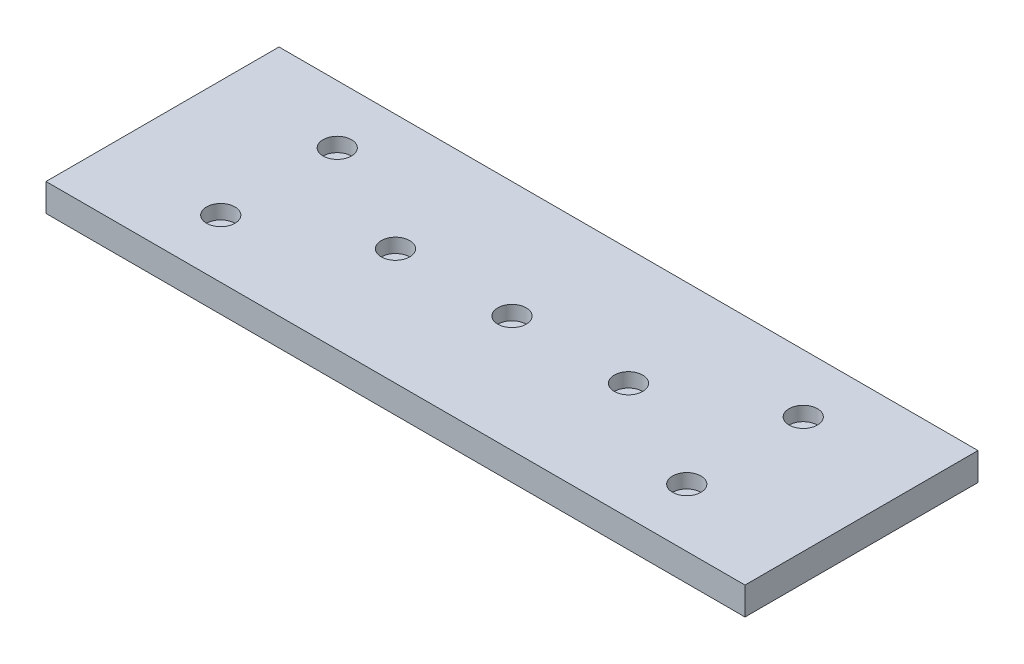
ISO-10303-21;
HEADER;
FILE_DESCRIPTION(('STEP AP214'),'2;1');
FILE_NAME('part.step','',(''),(''),'','','');
FILE_SCHEMA(('AUTOMOTIVE_DESIGN { 1 0 10303 214 1 1 1 1 }'));
ENDSEC;
DATA;
#1=APPLICATION_CONTEXT('core data for automotive mechanical design processes');
#2=APPLICATION_PROTOCOL_DEFINITION('international standard','automotive_design',2000,#1);
#3=PRODUCT_CONTEXT('',#1,'mechanical');
#4=PRODUCT('Part','Part','',(#3));
#5=PRODUCT_RELATED_PRODUCT_CATEGORY('part','',(#4));
#6=PRODUCT_DEFINITION_FORMATION('','',#4);
#7=PRODUCT_DEFINITION_CONTEXT('part definition',#1,'design');
#8=PRODUCT_DEFINITION('design','',#6,#7);
#9=PRODUCT_DEFINITION_SHAPE('','',#8);
#10=(LENGTH_UNIT() NAMED_UNIT(*) SI_UNIT(.MILLI.,.METRE.));
#11=(NAMED_UNIT(*) PLANE_ANGLE_UNIT() SI_UNIT($,.RADIAN.));
#12=(NAMED_UNIT(*) SI_UNIT($,.STERADIAN.) SOLID_ANGLE_UNIT());
#13=UNCERTAINTY_MEASURE_WITH_UNIT(LENGTH_MEASURE(1.E-05),#10,'distance_accuracy_value','');
#14=(GEOMETRIC_REPRESENTATION_CONTEXT(3) GLOBAL_UNCERTAINTY_ASSIGNED_CONTEXT((#13)) GLOBAL_UNIT_ASSIGNED_CONTEXT((#10,
#11,#12)) REPRESENTATION_CONTEXT('',''));
#15=CARTESIAN_POINT('',(0.,0.,0.));
#16=DIRECTION('',(0.,0.,1.));
#17=DIRECTION('',(1.,0.,0.));
#18=AXIS2_PLACEMENT_3D('',#15,#16,#17);
#19=CARTESIAN_POINT('',(0.,5.95,0.));
#20=DIRECTION('',(0.,1.,0.));
#21=DIRECTION('',(0.,0.,1.));
#22=AXIS2_PLACEMENT_3D('',#19,#20,#21);
#23=PLANE('',#22);
#24=CARTESIAN_POINT('',(-125.,5.95,-12.5));
#25=DIRECTION('',(0.,-1.,0.));
#26=DIRECTION('',(0.,0.,-1.));
#27=AXIS2_PLACEMENT_3D('',#24,#25,#26);
#28=CIRCLE('',#27,3.05000000000002);
#29=CARTESIAN_POINT('',(-125.,5.95,-15.55));
#30=VERTEX_POINT('',#29);
#31=EDGE_CURVE('E173',#30,#30,#28,.T.);
#32=ORIENTED_EDGE('',*,*,#31,.T.);
#33=EDGE_LOOP('',(#32));
#34=FACE_BOUND('',#33,.T.);
#35=CARTESIAN_POINT('',(-100.,5.95,-25.));
#36=DIRECTION('',(0.,-1.,0.));
#37=DIRECTION('',(0.,0.,-1.));
#38=AXIS2_PLACEMENT_3D('',#35,#36,#37);
#39=CIRCLE('',#38,3.04999999999999);
#40=CARTESIAN_POINT('',(-100.,5.95,-28.05));
#41=VERTEX_POINT('',#40);
#42=EDGE_CURVE('E133',#41,#41,#39,.T.);
#43=ORIENTED_EDGE('',*,*,#42,.T.);
#44=EDGE_LOOP('',(#43));
#45=FACE_BOUND('',#44,.T.);
#46=CARTESIAN_POINT('',(-125.,5.95,-37.5));
#47=DIRECTION('',(0.,-1.,0.));
#48=DIRECTION('',(0.,0.,-1.));
#49=AXIS2_PLACEMENT_3D('',#46,#47,#48);
#50=CIRCLE('',#49,3.05000000000002);
#51=CARTESIAN_POINT('',(-125.,5.95,-40.55));
#52=VERTEX_POINT('',#51);
#53=EDGE_CURVE('E129',#52,#52,#50,.T.);
#54=ORIENTED_EDGE('',*,*,#53,.T.);
#55=EDGE_LOOP('',(#54));
#56=FACE_BOUND('',#55,.T.);
#57=DIRECTION('',(0.,0.,-1.));
#58=VECTOR('',#57,1.);
#59=CARTESIAN_POINT('',(0.,5.95,0.));
#60=LINE('',#59,#58);
#61=CARTESIAN_POINT('',(0.,5.95,0.));
#62=VERTEX_POINT('',#61);
#63=CARTESIAN_POINT('',(0.,5.95,-50.));
#64=VERTEX_POINT('',#63);
#65=EDGE_CURVE('E92',#62,#64,#60,.T.);
#66=ORIENTED_EDGE('',*,*,#65,.T.);
#67=DIRECTION('',(-1.,0.,0.));
#68=VECTOR('',#67,1.);
#69=CARTESIAN_POINT('',(0.,5.95,-50.));
#70=LINE('',#69,#68);
#71=CARTESIAN_POINT('',(-150.,5.95,-50.));
#72=VERTEX_POINT('',#71);
#73=EDGE_CURVE('E87',#64,#72,#70,.T.);
#74=ORIENTED_EDGE('',*,*,#73,.T.);
#75=DIRECTION('',(0.,0.,1.));
#76=VECTOR('',#75,1.);
#77=CARTESIAN_POINT('',(-150.,5.95,0.));
#78=LINE('',#77,#76);
#79=CARTESIAN_POINT('',(-150.,5.95,0.));
#80=VERTEX_POINT('',#79);
#81=EDGE_CURVE('E90',#72,#80,#78,.T.);
#82=ORIENTED_EDGE('',*,*,#81,.T.);
#83=DIRECTION('',(1.,0.,0.));
#84=VECTOR('',#83,1.);
#85=CARTESIAN_POINT('',(0.,5.95,0.));
#86=LINE('',#85,#84);
#87=EDGE_CURVE('E57',#80,#62,#86,.T.);
#88=ORIENTED_EDGE('',*,*,#87,.T.);
#89=EDGE_LOOP('',(#66,#74,#82,#88));
#90=FACE_BOUND('',#89,.T.);
#91=CARTESIAN_POINT('',(-75.,5.95,-25.));
#92=DIRECTION('',(0.,1.,0.));
#93=DIRECTION('',(0.,0.,1.));
#94=AXIS2_PLACEMENT_3D('',#91,#92,#93);
#95=CIRCLE('',#94,3.04999999999999);
#96=CARTESIAN_POINT('',(-75.,5.95,-21.95));
#97=VERTEX_POINT('',#96);
#98=EDGE_CURVE('E165',#97,#97,#95,.T.);
#99=ORIENTED_EDGE('',*,*,#98,.F.);
#100=EDGE_LOOP('',(#99));
#101=FACE_BOUND('',#100,.T.);
#102=CARTESIAN_POINT('',(-50.,5.95,-25.));
#103=DIRECTION('',(0.,1.,0.));
#104=DIRECTION('',(0.,0.,1.));
#105=AXIS2_PLACEMENT_3D('',#102,#103,#104);
#106=CIRCLE('',#105,3.05);
#107=CARTESIAN_POINT('',(-50.,5.95,-21.95));
#108=VERTEX_POINT('',#107);
#109=EDGE_CURVE('E157',#108,#108,#106,.T.);
#110=ORIENTED_EDGE('',*,*,#109,.F.);
#111=EDGE_LOOP('',(#110));
#112=FACE_BOUND('',#111,.T.);
#113=CARTESIAN_POINT('',(-25.,5.95,-12.5));
#114=DIRECTION('',(0.,1.,0.));
#115=DIRECTION('',(0.,0.,1.));
#116=AXIS2_PLACEMENT_3D('',#113,#114,#115);
#117=CIRCLE('',#116,3.05);
#118=CARTESIAN_POINT('',(-25.,5.95,-9.45));
#119=VERTEX_POINT('',#118);
#120=EDGE_CURVE('E149',#119,#119,#117,.T.);
#121=ORIENTED_EDGE('',*,*,#120,.F.);
#122=EDGE_LOOP('',(#121));
#123=FACE_BOUND('',#122,.T.);
#124=CARTESIAN_POINT('',(-25.,5.95,-37.5));
#125=DIRECTION('',(0.,1.,0.));
#126=DIRECTION('',(0.,0.,1.));
#127=AXIS2_PLACEMENT_3D('',#124,#125,#126);
#128=CIRCLE('',#127,3.05);
#129=CARTESIAN_POINT('',(-25.,5.95,-34.45));
#130=VERTEX_POINT('',#129);
#131=EDGE_CURVE('E141',#130,#130,#128,.T.);
#132=ORIENTED_EDGE('',*,*,#131,.F.);
#133=EDGE_LOOP('',(#132));
#134=FACE_BOUND('',#133,.T.);
#135=ADVANCED_FACE('F39',(#34,#45,#56,#90,#101,#112,#123,#134),#23,.T.);
#136=CARTESIAN_POINT('',(0.,5.95,0.));
#137=DIRECTION('',(-1.,0.,0.));
#138=DIRECTION('',(0.,0.,1.));
#139=AXIS2_PLACEMENT_3D('',#136,#137,#138);
#140=PLANE('',#139);
#141=DIRECTION('',(0.,0.,-1.));
#142=VECTOR('',#141,1.);
#143=CARTESIAN_POINT('',(0.,0.,0.));
#144=LINE('',#143,#142);
#145=CARTESIAN_POINT('',(0.,0.,0.));
#146=VERTEX_POINT('',#145);
#147=CARTESIAN_POINT('',(0.,0.,-50.));
#148=VERTEX_POINT('',#147);
#149=EDGE_CURVE('E108',#146,#148,#144,.T.);
#150=ORIENTED_EDGE('',*,*,#149,.T.);
#151=DIRECTION('',(0.,-1.,0.));
#152=VECTOR('',#151,1.);
#153=CARTESIAN_POINT('',(0.,5.95,-50.));
#154=LINE('',#153,#152);
#155=EDGE_CURVE('E11',#64,#148,#154,.T.);
#156=ORIENTED_EDGE('',*,*,#155,.F.);
#157=ORIENTED_EDGE('',*,*,#65,.F.);
#158=DIRECTION('',(0.,-1.,0.));
#159=VECTOR('',#158,1.);
#160=CARTESIAN_POINT('',(0.,5.95,0.));
#161=LINE('',#160,#159);
#162=EDGE_CURVE('E104',#62,#146,#161,.T.);
#163=ORIENTED_EDGE('',*,*,#162,.T.);
#164=EDGE_LOOP('',(#150,#156,#157,#163));
#165=FACE_BOUND('',#164,.T.);
#166=ADVANCED_FACE('F41',(#165),#140,.F.);
#167=CARTESIAN_POINT('',(0.,5.95,-50.));
#168=DIRECTION('',(0.,0.,1.));
#169=DIRECTION('',(1.,0.,0.));
#170=AXIS2_PLACEMENT_3D('',#167,#168,#169);
#171=PLANE('',#170);
#172=DIRECTION('',(-1.,0.,0.));
#173=VECTOR('',#172,1.);
#174=CARTESIAN_POINT('',(0.,0.,-50.));
#175=LINE('',#174,#173);
#176=CARTESIAN_POINT('',(-150.,0.,-50.));
#177=VERTEX_POINT('',#176);
#178=EDGE_CURVE('E97',#148,#177,#175,.T.);
#179=ORIENTED_EDGE('',*,*,#178,.T.);
#180=DIRECTION('',(0.,-1.,0.));
#181=VECTOR('',#180,1.);
#182=CARTESIAN_POINT('',(-150.,5.95,-50.));
#183=LINE('',#182,#181);
#184=EDGE_CURVE('E49',#72,#177,#183,.T.);
#185=ORIENTED_EDGE('',*,*,#184,.F.);
#186=ORIENTED_EDGE('',*,*,#73,.F.);
#187=ORIENTED_EDGE('',*,*,#155,.T.);
#188=EDGE_LOOP('',(#179,#185,#186,#187));
#189=FACE_BOUND('',#188,.T.);
#190=ADVANCED_FACE('F96',(#189),#171,.F.);
#191=CARTESIAN_POINT('',(-150.,5.95,0.));
#192=DIRECTION('',(1.,0.,0.));
#193=DIRECTION('',(0.,0.,-1.));
#194=AXIS2_PLACEMENT_3D('',#191,#192,#193);
#195=PLANE('',#194);
#196=DIRECTION('',(0.,0.,1.));
#197=VECTOR('',#196,1.);
#198=CARTESIAN_POINT('',(-150.,0.,0.));
#199=LINE('',#198,#197);
#200=CARTESIAN_POINT('',(-150.,0.,0.));
#201=VERTEX_POINT('',#200);
#202=EDGE_CURVE('E74',#177,#201,#199,.T.);
#203=ORIENTED_EDGE('',*,*,#202,.T.);
#204=DIRECTION('',(0.,-1.,0.));
#205=VECTOR('',#204,1.);
#206=CARTESIAN_POINT('',(-150.,5.95,0.));
#207=LINE('',#206,#205);
#208=EDGE_CURVE('E99',#80,#201,#207,.T.);
#209=ORIENTED_EDGE('',*,*,#208,.F.);
#210=ORIENTED_EDGE('',*,*,#81,.F.);
#211=ORIENTED_EDGE('',*,*,#184,.T.);
#212=EDGE_LOOP('',(#203,#209,#210,#211));
#213=FACE_BOUND('',#212,.T.);
#214=ADVANCED_FACE('F100',(#213),#195,.F.);
#215=CARTESIAN_POINT('',(0.,5.95,0.));
#216=DIRECTION('',(0.,0.,-1.));
#217=DIRECTION('',(-1.,0.,0.));
#218=AXIS2_PLACEMENT_3D('',#215,#216,#217);
#219=PLANE('',#218);
#220=DIRECTION('',(1.,0.,0.));
#221=VECTOR('',#220,1.);
#222=CARTESIAN_POINT('',(0.,0.,0.));
#223=LINE('',#222,#221);
#224=EDGE_CURVE('E80',#201,#146,#223,.T.);
#225=ORIENTED_EDGE('',*,*,#224,.T.);
#226=ORIENTED_EDGE('',*,*,#162,.F.);
#227=ORIENTED_EDGE('',*,*,#87,.F.);
#228=ORIENTED_EDGE('',*,*,#208,.T.);
#229=EDGE_LOOP('',(#225,#226,#227,#228));
#230=FACE_BOUND('',#229,.T.);
#231=ADVANCED_FACE('F122',(#230),#219,.F.);
#232=CARTESIAN_POINT('',(0.,0.,0.));
#233=DIRECTION('',(0.,1.,0.));
#234=DIRECTION('',(0.,0.,1.));
#235=AXIS2_PLACEMENT_3D('',#232,#233,#234);
#236=PLANE('',#235);
#237=ORIENTED_EDGE('',*,*,#149,.F.);
#238=ORIENTED_EDGE('',*,*,#224,.F.);
#239=ORIENTED_EDGE('',*,*,#202,.F.);
#240=ORIENTED_EDGE('',*,*,#178,.F.);
#241=EDGE_LOOP('',(#237,#238,#239,#240));
#242=FACE_BOUND('',#241,.T.);
#243=ADVANCED_FACE('F125',(#242),#236,.F.);
#244=CARTESIAN_POINT('',(-125.,2.9,-37.5));
#245=DIRECTION('',(0.,1.,0.));
#246=DIRECTION('',(0.,0.,1.));
#247=AXIS2_PLACEMENT_3D('',#244,#245,#246);
#248=CYLINDRICAL_SURFACE('',#247,3.05000000000002);
#249=CARTESIAN_POINT('',(-125.,2.9,-37.5));
#250=DIRECTION('',(0.,-1.,0.));
#251=DIRECTION('',(0.,0.,-1.));
#252=AXIS2_PLACEMENT_3D('',#249,#250,#251);
#253=CIRCLE('',#252,3.05000000000002);
#254=CARTESIAN_POINT('',(-125.,2.9,-40.55));
#255=VERTEX_POINT('',#254);
#256=EDGE_CURVE('E112',#255,#255,#253,.T.);
#257=ORIENTED_EDGE('',*,*,#256,.T.);
#258=EDGE_LOOP('',(#257));
#259=FACE_BOUND('',#258,.T.);
#260=ORIENTED_EDGE('',*,*,#53,.F.);
#261=EDGE_LOOP('',(#260));
#262=FACE_BOUND('',#261,.T.);
#263=ADVANCED_FACE('F200',(#259,#262),#248,.F.);
#264=CARTESIAN_POINT('',(-125.,2.9,-37.5));
#265=DIRECTION('',(0.,-1.,0.));
#266=DIRECTION('',(0.,0.,-1.));
#267=AXIS2_PLACEMENT_3D('',#264,#265,#266);
#268=PLANE('',#267);
#269=ORIENTED_EDGE('',*,*,#256,.F.);
#270=EDGE_LOOP('',(#269));
#271=FACE_BOUND('',#270,.T.);
#272=ADVANCED_FACE('F190',(#271),#268,.F.);
#273=CARTESIAN_POINT('',(-100.,2.9,-25.));
#274=DIRECTION('',(0.,1.,0.));
#275=DIRECTION('',(0.,0.,1.));
#276=AXIS2_PLACEMENT_3D('',#273,#274,#275);
#277=CYLINDRICAL_SURFACE('',#276,3.04999999999999);
#278=CARTESIAN_POINT('',(-100.,2.9,-25.));
#279=DIRECTION('',(0.,-1.,0.));
#280=DIRECTION('',(0.,0.,-1.));
#281=AXIS2_PLACEMENT_3D('',#278,#279,#280);
#282=CIRCLE('',#281,3.04999999999999);
#283=CARTESIAN_POINT('',(-100.,2.9,-28.05));
#284=VERTEX_POINT('',#283);
#285=EDGE_CURVE('E177',#284,#284,#282,.T.);
#286=ORIENTED_EDGE('',*,*,#285,.T.);
#287=EDGE_LOOP('',(#286));
#288=FACE_BOUND('',#287,.T.);
#289=ORIENTED_EDGE('',*,*,#42,.F.);
#290=EDGE_LOOP('',(#289));
#291=FACE_BOUND('',#290,.T.);
#292=ADVANCED_FACE('F187',(#288,#291),#277,.F.);
#293=CARTESIAN_POINT('',(-100.,2.9,-25.));
#294=DIRECTION('',(0.,-1.,0.));
#295=DIRECTION('',(0.,0.,-1.));
#296=AXIS2_PLACEMENT_3D('',#293,#294,#295);
#297=PLANE('',#296);
#298=ORIENTED_EDGE('',*,*,#285,.F.);
#299=EDGE_LOOP('',(#298));
#300=FACE_BOUND('',#299,.T.);
#301=ADVANCED_FACE('F189',(#300),#297,.F.);
#302=CARTESIAN_POINT('',(-125.,2.9,-12.5));
#303=DIRECTION('',(0.,1.,0.));
#304=DIRECTION('',(0.,0.,1.));
#305=AXIS2_PLACEMENT_3D('',#302,#303,#304);
#306=CYLINDRICAL_SURFACE('',#305,3.05000000000002);
#307=CARTESIAN_POINT('',(-125.,2.9,-12.5));
#308=DIRECTION('',(0.,-1.,0.));
#309=DIRECTION('',(0.,0.,-1.));
#310=AXIS2_PLACEMENT_3D('',#307,#308,#309);
#311=CIRCLE('',#310,3.05000000000002);
#312=CARTESIAN_POINT('',(-125.,2.9,-15.55));
#313=VERTEX_POINT('',#312);
#314=EDGE_CURVE('E169',#313,#313,#311,.T.);
#315=ORIENTED_EDGE('',*,*,#314,.T.);
#316=EDGE_LOOP('',(#315));
#317=FACE_BOUND('',#316,.T.);
#318=ORIENTED_EDGE('',*,*,#31,.F.);
#319=EDGE_LOOP('',(#318));
#320=FACE_BOUND('',#319,.T.);
#321=ADVANCED_FACE('F197',(#317,#320),#306,.F.);
#322=CARTESIAN_POINT('',(-125.,2.9,-12.5));
#323=DIRECTION('',(0.,-1.,0.));
#324=DIRECTION('',(0.,0.,-1.));
#325=AXIS2_PLACEMENT_3D('',#322,#323,#324);
#326=PLANE('',#325);
#327=ORIENTED_EDGE('',*,*,#314,.F.);
#328=EDGE_LOOP('',(#327));
#329=FACE_BOUND('',#328,.T.);
#330=ADVANCED_FACE('F262',(#329),#326,.F.);
#331=CARTESIAN_POINT('',(-75.,2.9,-25.));
#332=DIRECTION('',(0.,1.,0.));
#333=DIRECTION('',(0.,0.,1.));
#334=AXIS2_PLACEMENT_3D('',#331,#332,#333);
#335=CYLINDRICAL_SURFACE('',#334,3.04999999999999);
#336=CARTESIAN_POINT('',(-75.,2.9,-25.));
#337=DIRECTION('',(0.,1.,0.));
#338=DIRECTION('',(0.,0.,1.));
#339=AXIS2_PLACEMENT_3D('',#336,#337,#338);
#340=CIRCLE('',#339,3.04999999999999);
#341=CARTESIAN_POINT('',(-75.,2.9,-21.95));
#342=VERTEX_POINT('',#341);
#343=EDGE_CURVE('E161',#342,#342,#340,.T.);
#344=ORIENTED_EDGE('',*,*,#343,.F.);
#345=EDGE_LOOP('',(#344));
#346=FACE_BOUND('',#345,.T.);
#347=ORIENTED_EDGE('',*,*,#98,.T.);
#348=EDGE_LOOP('',(#347));
#349=FACE_BOUND('',#348,.T.);
#350=ADVANCED_FACE('F272',(#346,#349),#335,.F.);
#351=CARTESIAN_POINT('',(-75.,2.9,-25.));
#352=DIRECTION('',(0.,1.,0.));
#353=DIRECTION('',(0.,0.,1.));
#354=AXIS2_PLACEMENT_3D('',#351,#352,#353);
#355=PLANE('',#354);
#356=ORIENTED_EDGE('',*,*,#343,.T.);
#357=EDGE_LOOP('',(#356));
#358=FACE_BOUND('',#357,.T.);
#359=ADVANCED_FACE('F282',(#358),#355,.T.);
#360=CARTESIAN_POINT('',(-50.,2.9,-25.));
#361=DIRECTION('',(0.,1.,0.));
#362=DIRECTION('',(0.,0.,1.));
#363=AXIS2_PLACEMENT_3D('',#360,#361,#362);
#364=CYLINDRICAL_SURFACE('',#363,3.05);
#365=CARTESIAN_POINT('',(-50.,2.9,-25.));
#366=DIRECTION('',(0.,1.,0.));
#367=DIRECTION('',(0.,0.,1.));
#368=AXIS2_PLACEMENT_3D('',#365,#366,#367);
#369=CIRCLE('',#368,3.05);
#370=CARTESIAN_POINT('',(-50.,2.9,-21.95));
#371=VERTEX_POINT('',#370);
#372=EDGE_CURVE('E153',#371,#371,#369,.T.);
#373=ORIENTED_EDGE('',*,*,#372,.F.);
#374=EDGE_LOOP('',(#373));
#375=FACE_BOUND('',#374,.T.);
#376=ORIENTED_EDGE('',*,*,#109,.T.);
#377=EDGE_LOOP('',(#376));
#378=FACE_BOUND('',#377,.T.);
#379=ADVANCED_FACE('F292',(#375,#378),#364,.F.);
#380=CARTESIAN_POINT('',(-50.,2.9,-25.));
#381=DIRECTION('',(0.,1.,0.));
#382=DIRECTION('',(0.,0.,1.));
#383=AXIS2_PLACEMENT_3D('',#380,#381,#382);
#384=PLANE('',#383);
#385=ORIENTED_EDGE('',*,*,#372,.T.);
#386=EDGE_LOOP('',(#385));
#387=FACE_BOUND('',#386,.T.);
#388=ADVANCED_FACE('F302',(#387),#384,.T.);
#389=CARTESIAN_POINT('',(-25.,2.9,-12.5));
#390=DIRECTION('',(0.,1.,0.));
#391=DIRECTION('',(0.,0.,1.));
#392=AXIS2_PLACEMENT_3D('',#389,#390,#391);
#393=CYLINDRICAL_SURFACE('',#392,3.05);
#394=CARTESIAN_POINT('',(-25.,2.9,-12.5));
#395=DIRECTION('',(0.,1.,0.));
#396=DIRECTION('',(0.,0.,1.));
#397=AXIS2_PLACEMENT_3D('',#394,#395,#396);
#398=CIRCLE('',#397,3.05);
#399=CARTESIAN_POINT('',(-25.,2.9,-9.45));
#400=VERTEX_POINT('',#399);
#401=EDGE_CURVE('E145',#400,#400,#398,.T.);
#402=ORIENTED_EDGE('',*,*,#401,.F.);
#403=EDGE_LOOP('',(#402));
#404=FACE_BOUND('',#403,.T.);
#405=ORIENTED_EDGE('',*,*,#120,.T.);
#406=EDGE_LOOP('',(#405));
#407=FACE_BOUND('',#406,.T.);
#408=ADVANCED_FACE('F312',(#404,#407),#393,.F.);
#409=CARTESIAN_POINT('',(-25.,2.9,-12.5));
#410=DIRECTION('',(0.,1.,0.));
#411=DIRECTION('',(0.,0.,1.));
#412=AXIS2_PLACEMENT_3D('',#409,#410,#411);
#413=PLANE('',#412);
#414=ORIENTED_EDGE('',*,*,#401,.T.);
#415=EDGE_LOOP('',(#414));
#416=FACE_BOUND('',#415,.T.);
#417=ADVANCED_FACE('F322',(#416),#413,.T.);
#418=CARTESIAN_POINT('',(-25.,2.9,-37.5));
#419=DIRECTION('',(0.,1.,0.));
#420=DIRECTION('',(0.,0.,1.));
#421=AXIS2_PLACEMENT_3D('',#418,#419,#420);
#422=CYLINDRICAL_SURFACE('',#421,3.05);
#423=CARTESIAN_POINT('',(-25.,2.9,-37.5));
#424=DIRECTION('',(0.,1.,0.));
#425=DIRECTION('',(0.,0.,1.));
#426=AXIS2_PLACEMENT_3D('',#423,#424,#425);
#427=CIRCLE('',#426,3.05);
#428=CARTESIAN_POINT('',(-25.,2.9,-34.45));
#429=VERTEX_POINT('',#428);
#430=EDGE_CURVE('E137',#429,#429,#427,.T.);
#431=ORIENTED_EDGE('',*,*,#430,.F.);
#432=EDGE_LOOP('',(#431));
#433=FACE_BOUND('',#432,.T.);
#434=ORIENTED_EDGE('',*,*,#131,.T.);
#435=EDGE_LOOP('',(#434));
#436=FACE_BOUND('',#435,.T.);
#437=ADVANCED_FACE('F332',(#433,#436),#422,.F.);
#438=CARTESIAN_POINT('',(-25.,2.9,-37.5));
#439=DIRECTION('',(0.,1.,0.));
#440=DIRECTION('',(0.,0.,1.));
#441=AXIS2_PLACEMENT_3D('',#438,#439,#440);
#442=PLANE('',#441);
#443=ORIENTED_EDGE('',*,*,#430,.T.);
#444=EDGE_LOOP('',(#443));
#445=FACE_BOUND('',#444,.T.);
#446=ADVANCED_FACE('F342',(#445),#442,.T.);
#447=CLOSED_SHELL('',(#135,#166,#190,#214,#231,#243,#263,#272,#292,#301,#321,#330,#350,#359,
#379,#388,#408,#417,#437,#446));
#448=MANIFOLD_SOLID_BREP('B2',#447);
#449=ADVANCED_BREP_SHAPE_REPRESENTATION('',(#18,#448),#14);
#450=SHAPE_DEFINITION_REPRESENTATION(#9,#449);
ENDSEC;
END-ISO-10303-21;
